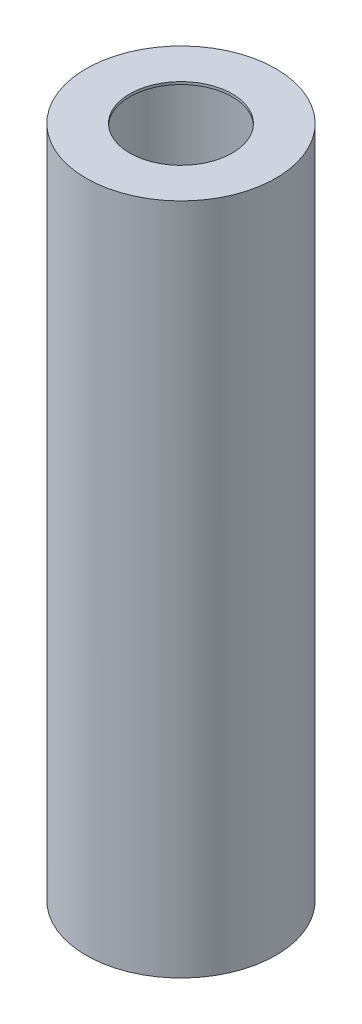
ISO-10303-21;
HEADER;
FILE_DESCRIPTION(('STEP AP214'),'2;1');
FILE_NAME('part.step','',(''),(''),'','','');
FILE_SCHEMA(('AUTOMOTIVE_DESIGN { 1 0 10303 214 1 1 1 1 }'));
ENDSEC;
DATA;
#1=APPLICATION_CONTEXT('core data for automotive mechanical design processes');
#2=APPLICATION_PROTOCOL_DEFINITION('international standard','automotive_design',2000,#1);
#3=PRODUCT_CONTEXT('',#1,'mechanical');
#4=PRODUCT('Part','Part','',(#3));
#5=PRODUCT_RELATED_PRODUCT_CATEGORY('part','',(#4));
#6=PRODUCT_DEFINITION_FORMATION('','',#4);
#7=PRODUCT_DEFINITION_CONTEXT('part definition',#1,'design');
#8=PRODUCT_DEFINITION('design','',#6,#7);
#9=PRODUCT_DEFINITION_SHAPE('','',#8);
#10=(LENGTH_UNIT() NAMED_UNIT(*) SI_UNIT(.MILLI.,.METRE.));
#11=(NAMED_UNIT(*) PLANE_ANGLE_UNIT() SI_UNIT($,.RADIAN.));
#12=(NAMED_UNIT(*) SI_UNIT($,.STERADIAN.) SOLID_ANGLE_UNIT());
#13=UNCERTAINTY_MEASURE_WITH_UNIT(LENGTH_MEASURE(1.E-05),#10,'distance_accuracy_value','');
#14=(GEOMETRIC_REPRESENTATION_CONTEXT(3) GLOBAL_UNCERTAINTY_ASSIGNED_CONTEXT((#13)) GLOBAL_UNIT_ASSIGNED_CONTEXT((#10,
#11,#12)) REPRESENTATION_CONTEXT('',''));
#15=CARTESIAN_POINT('',(0.,0.,0.));
#16=DIRECTION('',(0.,0.,1.));
#17=DIRECTION('',(1.,0.,0.));
#18=AXIS2_PLACEMENT_3D('',#15,#16,#17);
#19=CARTESIAN_POINT('',(0.,65.1,0.));
#20=DIRECTION('',(0.,-1.,0.));
#21=DIRECTION('',(0.,0.,-1.));
#22=AXIS2_PLACEMENT_3D('',#19,#20,#21);
#23=CYLINDRICAL_SURFACE('',#22,9.25);
#24=CARTESIAN_POINT('',(0.,65.35,0.));
#25=DIRECTION('',(0.,1.,0.));
#26=DIRECTION('',(0.,0.,1.));
#27=AXIS2_PLACEMENT_3D('',#24,#25,#26);
#28=CIRCLE('',#27,9.25);
#29=CARTESIAN_POINT('',(0.,65.35,9.25));
#30=VERTEX_POINT('',#29);
#31=EDGE_CURVE('E43',#30,#30,#28,.T.);
#32=ORIENTED_EDGE('',*,*,#31,.F.);
#33=EDGE_LOOP('',(#32));
#34=FACE_BOUND('',#33,.T.);
#35=CARTESIAN_POINT('',(0.,-0.25,0.));
#36=DIRECTION('',(0.,-1.,0.));
#37=DIRECTION('',(0.,0.,-1.));
#38=AXIS2_PLACEMENT_3D('',#35,#36,#37);
#39=CIRCLE('',#38,9.25);
#40=CARTESIAN_POINT('',(0.,-0.25,-9.25));
#41=VERTEX_POINT('',#40);
#42=EDGE_CURVE('E53',#41,#41,#39,.T.);
#43=ORIENTED_EDGE('',*,*,#42,.F.);
#44=EDGE_LOOP('',(#43));
#45=FACE_BOUND('',#44,.T.);
#46=ADVANCED_FACE('F33',(#34,#45),#23,.T.);
#47=CARTESIAN_POINT('',(0.,65.1,0.));
#48=DIRECTION('',(0.,-1.,0.));
#49=DIRECTION('',(0.,0.,-1.));
#50=AXIS2_PLACEMENT_3D('',#47,#48,#49);
#51=CYLINDRICAL_SURFACE('',#50,9.);
#52=CARTESIAN_POINT('',(0.,65.1,0.));
#53=DIRECTION('',(0.,1.,0.));
#54=DIRECTION('',(0.,0.,1.));
#55=AXIS2_PLACEMENT_3D('',#52,#53,#54);
#56=CIRCLE('',#55,9.);
#57=CARTESIAN_POINT('',(0.,65.1,9.));
#58=VERTEX_POINT('',#57);
#59=EDGE_CURVE('E39',#58,#58,#56,.T.);
#60=ORIENTED_EDGE('',*,*,#59,.T.);
#61=EDGE_LOOP('',(#60));
#62=FACE_BOUND('',#61,.T.);
#63=CARTESIAN_POINT('',(0.,0.,0.));
#64=DIRECTION('',(0.,1.,0.));
#65=DIRECTION('',(0.,0.,1.));
#66=AXIS2_PLACEMENT_3D('',#63,#64,#65);
#67=CIRCLE('',#66,9.);
#68=CARTESIAN_POINT('',(0.,0.,9.));
#69=VERTEX_POINT('',#68);
#70=EDGE_CURVE('E10',#69,#69,#67,.T.);
#71=ORIENTED_EDGE('',*,*,#70,.F.);
#72=EDGE_LOOP('',(#71));
#73=FACE_BOUND('',#72,.T.);
#74=ADVANCED_FACE('F82',(#62,#73),#51,.F.);
#75=CARTESIAN_POINT('',(0.,65.1,0.));
#76=DIRECTION('',(0.,1.,0.));
#77=DIRECTION('',(0.,0.,1.));
#78=AXIS2_PLACEMENT_3D('',#75,#76,#77);
#79=PLANE('',#78);
#80=CARTESIAN_POINT('',(0.,65.1,0.));
#81=DIRECTION('',(0.,1.,0.));
#82=DIRECTION('',(0.,0.,1.));
#83=AXIS2_PLACEMENT_3D('',#80,#81,#82);
#84=CIRCLE('',#83,5.);
#85=CARTESIAN_POINT('',(0.,65.1,5.));
#86=VERTEX_POINT('',#85);
#87=EDGE_CURVE('E50',#86,#86,#84,.T.);
#88=ORIENTED_EDGE('',*,*,#87,.T.);
#89=EDGE_LOOP('',(#88));
#90=FACE_BOUND('',#89,.T.);
#91=ORIENTED_EDGE('',*,*,#59,.F.);
#92=EDGE_LOOP('',(#91));
#93=FACE_BOUND('',#92,.T.);
#94=ADVANCED_FACE('F87',(#90,#93),#79,.F.);
#95=CARTESIAN_POINT('',(0.,65.35,0.));
#96=DIRECTION('',(0.,1.,0.));
#97=DIRECTION('',(0.,0.,1.));
#98=AXIS2_PLACEMENT_3D('',#95,#96,#97);
#99=PLANE('',#98);
#100=ORIENTED_EDGE('',*,*,#31,.T.);
#101=EDGE_LOOP('',(#100));
#102=FACE_BOUND('',#101,.T.);
#103=CARTESIAN_POINT('',(0.,65.35,0.));
#104=DIRECTION('',(0.,1.,0.));
#105=DIRECTION('',(0.,0.,1.));
#106=AXIS2_PLACEMENT_3D('',#103,#104,#105);
#107=CIRCLE('',#106,5.);
#108=CARTESIAN_POINT('',(0.,65.35,5.));
#109=VERTEX_POINT('',#108);
#110=EDGE_CURVE('E47',#109,#109,#107,.T.);
#111=ORIENTED_EDGE('',*,*,#110,.F.);
#112=EDGE_LOOP('',(#111));
#113=FACE_BOUND('',#112,.T.);
#114=ADVANCED_FACE('F92',(#102,#113),#99,.T.);
#115=CARTESIAN_POINT('',(0.,65.35,0.));
#116=DIRECTION('',(0.,-1.,0.));
#117=DIRECTION('',(0.,0.,-1.));
#118=AXIS2_PLACEMENT_3D('',#115,#116,#117);
#119=CYLINDRICAL_SURFACE('',#118,5.);
#120=ORIENTED_EDGE('',*,*,#110,.T.);
#121=EDGE_LOOP('',(#120));
#122=FACE_BOUND('',#121,.T.);
#123=ORIENTED_EDGE('',*,*,#87,.F.);
#124=EDGE_LOOP('',(#123));
#125=FACE_BOUND('',#124,.T.);
#126=ADVANCED_FACE('F78',(#122,#125),#119,.F.);
#127=CARTESIAN_POINT('',(0.,0.,0.));
#128=DIRECTION('',(0.,-1.,0.));
#129=DIRECTION('',(0.,0.,-1.));
#130=AXIS2_PLACEMENT_3D('',#127,#128,#129);
#131=PLANE('',#130);
#132=CARTESIAN_POINT('',(-0.172396434209077,0.,0.));
#133=DIRECTION('',(0.,-1.,0.));
#134=DIRECTION('',(0.,0.,-1.));
#135=AXIS2_PLACEMENT_3D('',#132,#133,#134);
#136=CIRCLE('',#135,5.);
#137=CARTESIAN_POINT('',(-0.172396434209077,0.,-5.));
#138=VERTEX_POINT('',#137);
#139=EDGE_CURVE('E59',#138,#138,#136,.T.);
#140=ORIENTED_EDGE('',*,*,#139,.T.);
#141=EDGE_LOOP('',(#140));
#142=FACE_BOUND('',#141,.T.);
#143=ORIENTED_EDGE('',*,*,#70,.T.);
#144=EDGE_LOOP('',(#143));
#145=FACE_BOUND('',#144,.T.);
#146=ADVANCED_FACE('F70',(#142,#145),#131,.F.);
#147=CARTESIAN_POINT('',(0.,-0.25,0.));
#148=DIRECTION('',(0.,-1.,0.));
#149=DIRECTION('',(0.,0.,-1.));
#150=AXIS2_PLACEMENT_3D('',#147,#148,#149);
#151=PLANE('',#150);
#152=ORIENTED_EDGE('',*,*,#42,.T.);
#153=EDGE_LOOP('',(#152));
#154=FACE_BOUND('',#153,.T.);
#155=CARTESIAN_POINT('',(-0.172396434209077,-0.25,0.));
#156=DIRECTION('',(0.,-1.,0.));
#157=DIRECTION('',(0.,0.,-1.));
#158=AXIS2_PLACEMENT_3D('',#155,#156,#157);
#159=CIRCLE('',#158,5.);
#160=CARTESIAN_POINT('',(-0.172396434209077,-0.25,-5.));
#161=VERTEX_POINT('',#160);
#162=EDGE_CURVE('E58',#161,#161,#159,.T.);
#163=ORIENTED_EDGE('',*,*,#162,.F.);
#164=EDGE_LOOP('',(#163));
#165=FACE_BOUND('',#164,.T.);
#166=ADVANCED_FACE('F68',(#154,#165),#151,.T.);
#167=CARTESIAN_POINT('',(-0.172396434209077,-0.25,0.));
#168=DIRECTION('',(0.,1.,0.));
#169=DIRECTION('',(0.,0.,1.));
#170=AXIS2_PLACEMENT_3D('',#167,#168,#169);
#171=CYLINDRICAL_SURFACE('',#170,5.);
#172=ORIENTED_EDGE('',*,*,#162,.T.);
#173=EDGE_LOOP('',(#172));
#174=FACE_BOUND('',#173,.T.);
#175=ORIENTED_EDGE('',*,*,#139,.F.);
#176=EDGE_LOOP('',(#175));
#177=FACE_BOUND('',#176,.T.);
#178=ADVANCED_FACE('F65',(#174,#177),#171,.F.);
#179=CLOSED_SHELL('',(#46,#74,#94,#114,#126,#146,#166,#178));
#180=MANIFOLD_SOLID_BREP('B2',#179);
#181=ADVANCED_BREP_SHAPE_REPRESENTATION('',(#18,#180),#14);
#182=SHAPE_DEFINITION_REPRESENTATION(#9,#181);
ENDSEC;
END-ISO-10303-21;
